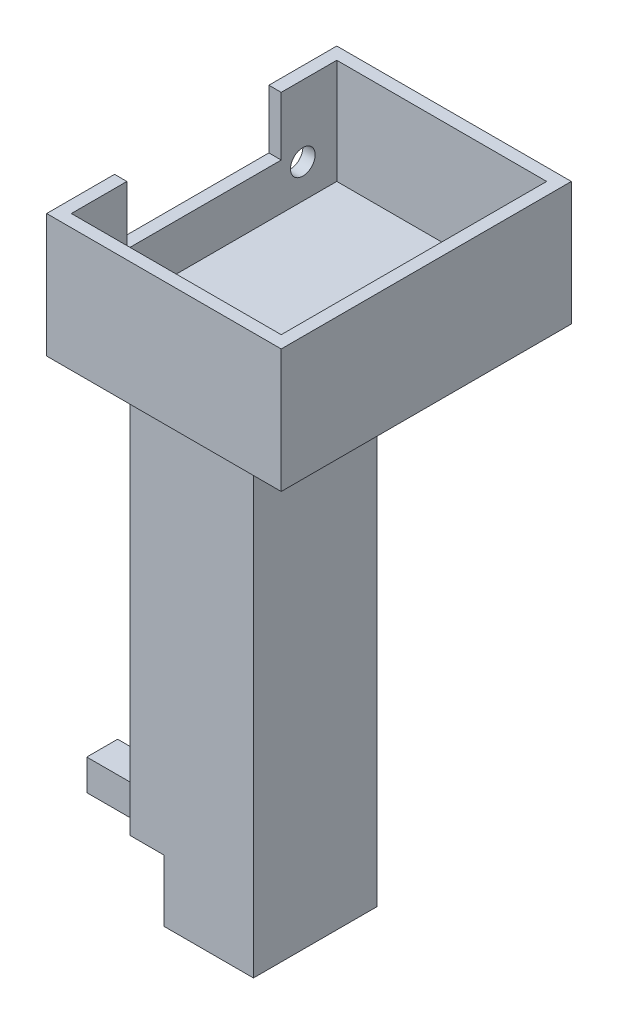
ISO-10303-21;
HEADER;
FILE_DESCRIPTION(('STEP AP214'),'2;1');
FILE_NAME('part.step','',(''),(''),'','','');
FILE_SCHEMA(('AUTOMOTIVE_DESIGN { 1 0 10303 214 1 1 1 1 }'));
ENDSEC;
DATA;
#1=APPLICATION_CONTEXT('core data for automotive mechanical design processes');
#2=APPLICATION_PROTOCOL_DEFINITION('international standard','automotive_design',2000,#1);
#3=PRODUCT_CONTEXT('',#1,'mechanical');
#4=PRODUCT('Part','Part','',(#3));
#5=PRODUCT_RELATED_PRODUCT_CATEGORY('part','',(#4));
#6=PRODUCT_DEFINITION_FORMATION('','',#4);
#7=PRODUCT_DEFINITION_CONTEXT('part definition',#1,'design');
#8=PRODUCT_DEFINITION('design','',#6,#7);
#9=PRODUCT_DEFINITION_SHAPE('','',#8);
#10=(LENGTH_UNIT() NAMED_UNIT(*) SI_UNIT(.MILLI.,.METRE.));
#11=(NAMED_UNIT(*) PLANE_ANGLE_UNIT() SI_UNIT($,.RADIAN.));
#12=(NAMED_UNIT(*) SI_UNIT($,.STERADIAN.) SOLID_ANGLE_UNIT());
#13=UNCERTAINTY_MEASURE_WITH_UNIT(LENGTH_MEASURE(1.E-05),#10,'distance_accuracy_value','');
#14=(GEOMETRIC_REPRESENTATION_CONTEXT(3) GLOBAL_UNCERTAINTY_ASSIGNED_CONTEXT((#13)) GLOBAL_UNIT_ASSIGNED_CONTEXT((#10,
#11,#12)) REPRESENTATION_CONTEXT('',''));
#15=CARTESIAN_POINT('',(0.,0.,0.));
#16=DIRECTION('',(0.,0.,1.));
#17=DIRECTION('',(1.,0.,0.));
#18=AXIS2_PLACEMENT_3D('',#15,#16,#17);
#19=CARTESIAN_POINT('',(12.,10.5,-95.));
#20=DIRECTION('',(1.,0.,0.));
#21=DIRECTION('',(0.,0.,-1.));
#22=AXIS2_PLACEMENT_3D('',#19,#20,#21);
#23=PLANE('',#22);
#24=CARTESIAN_POINT('',(12.,8.5,-87.5));
#25=DIRECTION('',(1.,0.,0.));
#26=DIRECTION('',(0.,0.,-1.));
#27=AXIS2_PLACEMENT_3D('',#24,#25,#26);
#28=CIRCLE('',#27,2.00000000000001);
#29=CARTESIAN_POINT('',(12.,8.5,-89.5));
#30=VERTEX_POINT('',#29);
#31=EDGE_CURVE('E294',#30,#30,#28,.F.);
#32=ORIENTED_EDGE('',*,*,#31,.F.);
#33=EDGE_LOOP('',(#32));
#34=FACE_BOUND('',#33,.T.);
#35=CARTESIAN_POINT('',(12.,8.5,-55.5));
#36=DIRECTION('',(1.,0.,0.));
#37=DIRECTION('',(0.,0.,-1.));
#38=AXIS2_PLACEMENT_3D('',#35,#36,#37);
#39=CIRCLE('',#38,2.);
#40=CARTESIAN_POINT('',(12.,8.5,-57.5));
#41=VERTEX_POINT('',#40);
#42=EDGE_CURVE('E293',#41,#41,#39,.F.);
#43=ORIENTED_EDGE('',*,*,#42,.F.);
#44=EDGE_LOOP('',(#43));
#45=FACE_BOUND('',#44,.T.);
#46=DIRECTION('',(0.,0.,-1.));
#47=VECTOR('',#46,1.);
#48=CARTESIAN_POINT('',(12.,-74.,-74.));
#49=LINE('',#48,#47);
#50=CARTESIAN_POINT('',(12.,-74.,-69.));
#51=VERTEX_POINT('',#50);
#52=CARTESIAN_POINT('',(12.,-74.,-74.));
#53=VERTEX_POINT('',#52);
#54=EDGE_CURVE('E207',#51,#53,#49,.T.);
#55=ORIENTED_EDGE('',*,*,#54,.F.);
#56=DIRECTION('',(0.,0.,-1.));
#57=VECTOR('',#56,1.);
#58=CARTESIAN_POINT('',(12.,-74.,-61.5));
#59=LINE('',#58,#57);
#60=CARTESIAN_POINT('',(12.,-74.,-61.5));
#61=VERTEX_POINT('',#60);
#62=EDGE_CURVE('E224',#61,#51,#59,.T.);
#63=ORIENTED_EDGE('',*,*,#62,.F.);
#64=DIRECTION('',(0.,1.,0.));
#65=VECTOR('',#64,1.);
#66=CARTESIAN_POINT('',(12.,-199.284271247462,-61.5));
#67=LINE('',#66,#65);
#68=CARTESIAN_POINT('',(12.,0.,-61.5));
#69=VERTEX_POINT('',#68);
#70=EDGE_CURVE('E280',#61,#69,#67,.T.);
#71=ORIENTED_EDGE('',*,*,#70,.T.);
#72=DIRECTION('',(0.,0.,1.));
#73=VECTOR('',#72,1.);
#74=CARTESIAN_POINT('',(12.,0.,-95.));
#75=LINE('',#74,#73);
#76=CARTESIAN_POINT('',(12.,0.,-48.));
#77=VERTEX_POINT('',#76);
#78=EDGE_CURVE('E386',#69,#77,#75,.T.);
#79=ORIENTED_EDGE('',*,*,#78,.T.);
#80=DIRECTION('',(0.,-1.,0.));
#81=VECTOR('',#80,1.);
#82=CARTESIAN_POINT('',(12.,10.5,-48.));
#83=LINE('',#82,#81);
#84=CARTESIAN_POINT('',(12.,20.,-48.));
#85=VERTEX_POINT('',#84);
#86=EDGE_CURVE('E393',#85,#77,#83,.T.);
#87=ORIENTED_EDGE('',*,*,#86,.F.);
#88=DIRECTION('',(0.,0.,1.));
#89=VECTOR('',#88,1.);
#90=CARTESIAN_POINT('',(12.,20.,-59.));
#91=LINE('',#90,#89);
#92=CARTESIAN_POINT('',(12.,20.,-59.));
#93=VERTEX_POINT('',#92);
#94=EDGE_CURVE('E310',#93,#85,#91,.T.);
#95=ORIENTED_EDGE('',*,*,#94,.F.);
#96=DIRECTION('',(0.,-1.,0.));
#97=VECTOR('',#96,1.);
#98=CARTESIAN_POINT('',(12.,20.,-59.));
#99=LINE('',#98,#97);
#100=CARTESIAN_POINT('',(12.,10.5,-59.));
#101=VERTEX_POINT('',#100);
#102=EDGE_CURVE('E345',#93,#101,#99,.T.);
#103=ORIENTED_EDGE('',*,*,#102,.T.);
#104=DIRECTION('',(0.,0.,1.));
#105=VECTOR('',#104,1.);
#106=CARTESIAN_POINT('',(12.,10.5,-95.));
#107=LINE('',#106,#105);
#108=CARTESIAN_POINT('',(12.,10.5,-84.));
#109=VERTEX_POINT('',#108);
#110=EDGE_CURVE('E378',#109,#101,#107,.T.);
#111=ORIENTED_EDGE('',*,*,#110,.F.);
#112=DIRECTION('',(0.,-1.,0.));
#113=VECTOR('',#112,1.);
#114=CARTESIAN_POINT('',(12.,20.,-84.));
#115=LINE('',#114,#113);
#116=CARTESIAN_POINT('',(12.,20.,-84.));
#117=VERTEX_POINT('',#116);
#118=EDGE_CURVE('E342',#117,#109,#115,.T.);
#119=ORIENTED_EDGE('',*,*,#118,.F.);
#120=DIRECTION('',(0.,0.,1.));
#121=VECTOR('',#120,1.);
#122=CARTESIAN_POINT('',(12.,20.,-84.));
#123=LINE('',#122,#121);
#124=CARTESIAN_POINT('',(12.,20.,-95.));
#125=VERTEX_POINT('',#124);
#126=EDGE_CURVE('E322',#125,#117,#123,.T.);
#127=ORIENTED_EDGE('',*,*,#126,.F.);
#128=DIRECTION('',(0.,-1.,0.));
#129=VECTOR('',#128,1.);
#130=CARTESIAN_POINT('',(12.,10.5,-95.));
#131=LINE('',#130,#129);
#132=CARTESIAN_POINT('',(12.,0.,-95.));
#133=VERTEX_POINT('',#132);
#134=EDGE_CURVE('E46',#125,#133,#131,.T.);
#135=ORIENTED_EDGE('',*,*,#134,.T.);
#136=CARTESIAN_POINT('',(12.,0.,-81.5));
#137=VERTEX_POINT('',#136);
#138=EDGE_CURVE('E387',#133,#137,#75,.T.);
#139=ORIENTED_EDGE('',*,*,#138,.T.);
#140=DIRECTION('',(0.,1.,0.));
#141=VECTOR('',#140,1.);
#142=CARTESIAN_POINT('',(12.,-199.284271247462,-81.5));
#143=LINE('',#142,#141);
#144=CARTESIAN_POINT('',(12.,-74.,-81.5));
#145=VERTEX_POINT('',#144);
#146=EDGE_CURVE('E287',#145,#137,#143,.T.);
#147=ORIENTED_EDGE('',*,*,#146,.F.);
#148=DIRECTION('',(0.,0.,-1.));
#149=VECTOR('',#148,1.);
#150=CARTESIAN_POINT('',(12.,-74.,-74.));
#151=LINE('',#150,#149);
#152=EDGE_CURVE('E222',#53,#145,#151,.T.);
#153=ORIENTED_EDGE('',*,*,#152,.F.);
#154=EDGE_LOOP('',(#55,#63,#71,#79,#87,#95,#103,#111,#119,#127,#135,#139,#147,#153));
#155=FACE_BOUND('',#154,.T.);
#156=ADVANCED_FACE('F38',(#34,#45,#155),#23,.F.);
#157=CARTESIAN_POINT('',(0.,-84.,0.));
#158=DIRECTION('',(0.,1.,0.));
#159=DIRECTION('',(0.,0.,1.));
#160=AXIS2_PLACEMENT_3D('',#157,#158,#159);
#161=PLANE('',#160);
#162=DIRECTION('',(0.,0.,1.));
#163=VECTOR('',#162,1.);
#164=CARTESIAN_POINT('',(17.5,-84.,-81.5));
#165=LINE('',#164,#163);
#166=CARTESIAN_POINT('',(17.5,-84.,-81.5));
#167=VERTEX_POINT('',#166);
#168=CARTESIAN_POINT('',(17.5,-84.,-61.5));
#169=VERTEX_POINT('',#168);
#170=EDGE_CURVE('E237',#167,#169,#165,.T.);
#171=ORIENTED_EDGE('',*,*,#170,.F.);
#172=DIRECTION('',(-1.,0.,0.));
#173=VECTOR('',#172,1.);
#174=CARTESIAN_POINT('',(12.,-84.,-81.5));
#175=LINE('',#174,#173);
#176=CARTESIAN_POINT('',(32.,-84.,-81.5));
#177=VERTEX_POINT('',#176);
#178=EDGE_CURVE('E269',#177,#167,#175,.T.);
#179=ORIENTED_EDGE('',*,*,#178,.F.);
#180=DIRECTION('',(0.,0.,-1.));
#181=VECTOR('',#180,1.);
#182=CARTESIAN_POINT('',(32.,-84.,-81.5));
#183=LINE('',#182,#181);
#184=CARTESIAN_POINT('',(32.,-84.,-61.5));
#185=VERTEX_POINT('',#184);
#186=EDGE_CURVE('E266',#185,#177,#183,.T.);
#187=ORIENTED_EDGE('',*,*,#186,.F.);
#188=DIRECTION('',(1.,0.,0.));
#189=VECTOR('',#188,1.);
#190=CARTESIAN_POINT('',(12.,-84.,-61.5));
#191=LINE('',#190,#189);
#192=EDGE_CURVE('E270',#169,#185,#191,.T.);
#193=ORIENTED_EDGE('',*,*,#192,.F.);
#194=EDGE_LOOP('',(#171,#179,#187,#193));
#195=FACE_BOUND('',#194,.T.);
#196=ADVANCED_FACE('F433',(#195),#161,.F.);
#197=CARTESIAN_POINT('',(0.,0.,0.));
#198=DIRECTION('',(0.,1.,0.));
#199=DIRECTION('',(0.,0.,1.));
#200=AXIS2_PLACEMENT_3D('',#197,#198,#199);
#201=PLANE('',#200);
#202=DIRECTION('',(-1.,0.,0.));
#203=VECTOR('',#202,1.);
#204=CARTESIAN_POINT('',(12.,0.,-61.5));
#205=LINE('',#204,#203);
#206=CARTESIAN_POINT('',(32.,0.,-61.5));
#207=VERTEX_POINT('',#206);
#208=EDGE_CURVE('E61',#207,#69,#205,.T.);
#209=ORIENTED_EDGE('',*,*,#208,.F.);
#210=DIRECTION('',(0.,0.,1.));
#211=VECTOR('',#210,1.);
#212=CARTESIAN_POINT('',(32.,0.,-81.5));
#213=LINE('',#212,#211);
#214=CARTESIAN_POINT('',(32.,0.,-81.5));
#215=VERTEX_POINT('',#214);
#216=EDGE_CURVE('E276',#215,#207,#213,.T.);
#217=ORIENTED_EDGE('',*,*,#216,.F.);
#218=DIRECTION('',(1.,0.,0.));
#219=VECTOR('',#218,1.);
#220=CARTESIAN_POINT('',(12.,0.,-81.5));
#221=LINE('',#220,#219);
#222=EDGE_CURVE('E255',#137,#215,#221,.T.);
#223=ORIENTED_EDGE('',*,*,#222,.F.);
#224=ORIENTED_EDGE('',*,*,#138,.F.);
#225=DIRECTION('',(-1.,0.,0.));
#226=VECTOR('',#225,1.);
#227=CARTESIAN_POINT('',(50.,0.,-95.));
#228=LINE('',#227,#226);
#229=CARTESIAN_POINT('',(50.,0.,-95.));
#230=VERTEX_POINT('',#229);
#231=EDGE_CURVE('E384',#230,#133,#228,.T.);
#232=ORIENTED_EDGE('',*,*,#231,.F.);
#233=DIRECTION('',(0.,0.,-1.));
#234=VECTOR('',#233,1.);
#235=CARTESIAN_POINT('',(50.,0.,-48.));
#236=LINE('',#235,#234);
#237=CARTESIAN_POINT('',(50.,0.,-48.));
#238=VERTEX_POINT('',#237);
#239=EDGE_CURVE('E377',#238,#230,#236,.T.);
#240=ORIENTED_EDGE('',*,*,#239,.F.);
#241=DIRECTION('',(1.,0.,0.));
#242=VECTOR('',#241,1.);
#243=CARTESIAN_POINT('',(12.,0.,-48.));
#244=LINE('',#243,#242);
#245=EDGE_CURVE('E381',#77,#238,#244,.T.);
#246=ORIENTED_EDGE('',*,*,#245,.F.);
#247=ORIENTED_EDGE('',*,*,#78,.F.);
#248=EDGE_LOOP('',(#209,#217,#223,#224,#232,#240,#246,#247));
#249=FACE_BOUND('',#248,.T.);
#250=ADVANCED_FACE('F404',(#249),#201,.F.);
#251=CARTESIAN_POINT('',(0.,10.5,0.));
#252=DIRECTION('',(0.,1.,0.));
#253=DIRECTION('',(0.,0.,1.));
#254=AXIS2_PLACEMENT_3D('',#251,#252,#253);
#255=PLANE('',#254);
#256=DIRECTION('',(1.,0.,0.));
#257=VECTOR('',#256,1.);
#258=CARTESIAN_POINT('',(14.,10.5,-84.));
#259=LINE('',#258,#257);
#260=CARTESIAN_POINT('',(14.,10.5,-84.));
#261=VERTEX_POINT('',#260);
#262=EDGE_CURVE('E306',#109,#261,#259,.T.);
#263=ORIENTED_EDGE('',*,*,#262,.F.);
#264=ORIENTED_EDGE('',*,*,#110,.T.);
#265=DIRECTION('',(-1.,0.,0.));
#266=VECTOR('',#265,1.);
#267=CARTESIAN_POINT('',(14.,10.5,-59.));
#268=LINE('',#267,#266);
#269=CARTESIAN_POINT('',(14.,10.5,-59.));
#270=VERTEX_POINT('',#269);
#271=EDGE_CURVE('E297',#270,#101,#268,.T.);
#272=ORIENTED_EDGE('',*,*,#271,.F.);
#273=DIRECTION('',(0.,0.,1.));
#274=VECTOR('',#273,1.);
#275=CARTESIAN_POINT('',(14.,10.5,-93.));
#276=LINE('',#275,#274);
#277=EDGE_CURVE('E363',#261,#270,#276,.T.);
#278=ORIENTED_EDGE('',*,*,#277,.F.);
#279=EDGE_LOOP('',(#263,#264,#272,#278));
#280=FACE_BOUND('',#279,.T.);
#281=ADVANCED_FACE('F440',(#280),#255,.T.);
#282=CARTESIAN_POINT('',(50.,10.5,-48.));
#283=DIRECTION('',(-1.,0.,0.));
#284=DIRECTION('',(0.,0.,1.));
#285=AXIS2_PLACEMENT_3D('',#282,#283,#284);
#286=PLANE('',#285);
#287=ORIENTED_EDGE('',*,*,#239,.T.);
#288=DIRECTION('',(0.,-1.,0.));
#289=VECTOR('',#288,1.);
#290=CARTESIAN_POINT('',(50.,10.5,-95.));
#291=LINE('',#290,#289);
#292=CARTESIAN_POINT('',(50.,20.,-95.));
#293=VERTEX_POINT('',#292);
#294=EDGE_CURVE('E12',#293,#230,#291,.T.);
#295=ORIENTED_EDGE('',*,*,#294,.F.);
#296=DIRECTION('',(0.,0.,-1.));
#297=VECTOR('',#296,1.);
#298=CARTESIAN_POINT('',(50.,20.,-48.));
#299=LINE('',#298,#297);
#300=CARTESIAN_POINT('',(50.,20.,-48.));
#301=VERTEX_POINT('',#300);
#302=EDGE_CURVE('E316',#301,#293,#299,.T.);
#303=ORIENTED_EDGE('',*,*,#302,.F.);
#304=DIRECTION('',(0.,-1.,0.));
#305=VECTOR('',#304,1.);
#306=CARTESIAN_POINT('',(50.,10.5,-48.));
#307=LINE('',#306,#305);
#308=EDGE_CURVE('E380',#301,#238,#307,.T.);
#309=ORIENTED_EDGE('',*,*,#308,.T.);
#310=EDGE_LOOP('',(#287,#295,#303,#309));
#311=FACE_BOUND('',#310,.T.);
#312=ADVANCED_FACE('F40',(#311),#286,.F.);
#313=CARTESIAN_POINT('',(50.,10.5,-95.));
#314=DIRECTION('',(0.,0.,1.));
#315=DIRECTION('',(1.,0.,0.));
#316=AXIS2_PLACEMENT_3D('',#313,#314,#315);
#317=PLANE('',#316);
#318=ORIENTED_EDGE('',*,*,#231,.T.);
#319=ORIENTED_EDGE('',*,*,#134,.F.);
#320=DIRECTION('',(-1.,0.,0.));
#321=VECTOR('',#320,1.);
#322=CARTESIAN_POINT('',(12.,20.,-95.));
#323=LINE('',#322,#321);
#324=EDGE_CURVE('E319',#293,#125,#323,.T.);
#325=ORIENTED_EDGE('',*,*,#324,.F.);
#326=ORIENTED_EDGE('',*,*,#294,.T.);
#327=EDGE_LOOP('',(#318,#319,#325,#326));
#328=FACE_BOUND('',#327,.T.);
#329=ADVANCED_FACE('F498',(#328),#317,.F.);
#330=CARTESIAN_POINT('',(12.,10.5,-48.));
#331=DIRECTION('',(0.,0.,-1.));
#332=DIRECTION('',(-1.,0.,0.));
#333=AXIS2_PLACEMENT_3D('',#330,#331,#332);
#334=PLANE('',#333);
#335=ORIENTED_EDGE('',*,*,#245,.T.);
#336=ORIENTED_EDGE('',*,*,#308,.F.);
#337=DIRECTION('',(1.,0.,0.));
#338=VECTOR('',#337,1.);
#339=CARTESIAN_POINT('',(12.,20.,-48.));
#340=LINE('',#339,#338);
#341=EDGE_CURVE('E313',#85,#301,#340,.T.);
#342=ORIENTED_EDGE('',*,*,#341,.F.);
#343=ORIENTED_EDGE('',*,*,#86,.T.);
#344=EDGE_LOOP('',(#335,#336,#342,#343));
#345=FACE_BOUND('',#344,.T.);
#346=ADVANCED_FACE('F492',(#345),#334,.F.);
#347=CARTESIAN_POINT('',(48.,10.5,-93.));
#348=DIRECTION('',(0.,0.,1.));
#349=DIRECTION('',(1.,0.,0.));
#350=AXIS2_PLACEMENT_3D('',#347,#348,#349);
#351=PLANE('',#350);
#352=DIRECTION('',(-1.,0.,0.));
#353=VECTOR('',#352,1.);
#354=CARTESIAN_POINT('',(14.,3.,-93.));
#355=LINE('',#354,#353);
#356=CARTESIAN_POINT('',(48.,3.,-93.));
#357=VERTEX_POINT('',#356);
#358=CARTESIAN_POINT('',(14.,3.,-93.));
#359=VERTEX_POINT('',#358);
#360=EDGE_CURVE('E360',#357,#359,#355,.T.);
#361=ORIENTED_EDGE('',*,*,#360,.F.);
#362=DIRECTION('',(0.,-1.,0.));
#363=VECTOR('',#362,1.);
#364=CARTESIAN_POINT('',(48.,10.5,-93.));
#365=LINE('',#364,#363);
#366=CARTESIAN_POINT('',(48.,20.,-93.));
#367=VERTEX_POINT('',#366);
#368=EDGE_CURVE('E366',#367,#357,#365,.T.);
#369=ORIENTED_EDGE('',*,*,#368,.F.);
#370=DIRECTION('',(1.,0.,0.));
#371=VECTOR('',#370,1.);
#372=CARTESIAN_POINT('',(48.,20.,-93.));
#373=LINE('',#372,#371);
#374=CARTESIAN_POINT('',(14.,20.,-93.));
#375=VERTEX_POINT('',#374);
#376=EDGE_CURVE('E329',#375,#367,#373,.T.);
#377=ORIENTED_EDGE('',*,*,#376,.F.);
#378=DIRECTION('',(0.,-1.,0.));
#379=VECTOR('',#378,1.);
#380=CARTESIAN_POINT('',(14.,10.5,-93.));
#381=LINE('',#380,#379);
#382=EDGE_CURVE('E374',#375,#359,#381,.T.);
#383=ORIENTED_EDGE('',*,*,#382,.T.);
#384=EDGE_LOOP('',(#361,#369,#377,#383));
#385=FACE_BOUND('',#384,.T.);
#386=ADVANCED_FACE('F488',(#385),#351,.T.);
#387=CARTESIAN_POINT('',(14.,10.5,-93.));
#388=DIRECTION('',(1.,0.,0.));
#389=DIRECTION('',(0.,0.,-1.));
#390=AXIS2_PLACEMENT_3D('',#387,#388,#389);
#391=PLANE('',#390);
#392=CARTESIAN_POINT('',(14.,8.5,-55.5));
#393=DIRECTION('',(1.,0.,0.));
#394=DIRECTION('',(0.,0.,-1.));
#395=AXIS2_PLACEMENT_3D('',#392,#393,#394);
#396=CIRCLE('',#395,2.);
#397=CARTESIAN_POINT('',(14.,8.5,-57.5));
#398=VERTEX_POINT('',#397);
#399=EDGE_CURVE('E290',#398,#398,#396,.T.);
#400=ORIENTED_EDGE('',*,*,#399,.F.);
#401=EDGE_LOOP('',(#400));
#402=FACE_BOUND('',#401,.T.);
#403=CARTESIAN_POINT('',(14.,8.5,-87.5));
#404=DIRECTION('',(1.,0.,0.));
#405=DIRECTION('',(0.,0.,1.));
#406=AXIS2_PLACEMENT_3D('',#403,#404,#405);
#407=CIRCLE('',#406,2.00000000000001);
#408=CARTESIAN_POINT('',(14.,8.5,-85.5));
#409=VERTEX_POINT('',#408);
#410=EDGE_CURVE('E273',#409,#409,#407,.T.);
#411=ORIENTED_EDGE('',*,*,#410,.F.);
#412=EDGE_LOOP('',(#411));
#413=FACE_BOUND('',#412,.T.);
#414=DIRECTION('',(0.,0.,1.));
#415=VECTOR('',#414,1.);
#416=CARTESIAN_POINT('',(14.,3.,-93.));
#417=LINE('',#416,#415);
#418=CARTESIAN_POINT('',(14.,3.,-50.));
#419=VERTEX_POINT('',#418);
#420=EDGE_CURVE('E351',#359,#419,#417,.T.);
#421=ORIENTED_EDGE('',*,*,#420,.F.);
#422=ORIENTED_EDGE('',*,*,#382,.F.);
#423=DIRECTION('',(0.,0.,-1.));
#424=VECTOR('',#423,1.);
#425=CARTESIAN_POINT('',(14.,20.,-93.));
#426=LINE('',#425,#424);
#427=CARTESIAN_POINT('',(14.,20.,-84.));
#428=VERTEX_POINT('',#427);
#429=EDGE_CURVE('E326',#428,#375,#426,.T.);
#430=ORIENTED_EDGE('',*,*,#429,.F.);
#431=DIRECTION('',(0.,-1.,0.));
#432=VECTOR('',#431,1.);
#433=CARTESIAN_POINT('',(14.,20.,-84.));
#434=LINE('',#433,#432);
#435=EDGE_CURVE('E335',#428,#261,#434,.T.);
#436=ORIENTED_EDGE('',*,*,#435,.T.);
#437=ORIENTED_EDGE('',*,*,#277,.T.);
#438=DIRECTION('',(0.,-1.,0.));
#439=VECTOR('',#438,1.);
#440=CARTESIAN_POINT('',(14.,20.,-59.));
#441=LINE('',#440,#439);
#442=CARTESIAN_POINT('',(14.,20.,-59.));
#443=VERTEX_POINT('',#442);
#444=EDGE_CURVE('E348',#443,#270,#441,.T.);
#445=ORIENTED_EDGE('',*,*,#444,.F.);
#446=DIRECTION('',(0.,0.,-1.));
#447=VECTOR('',#446,1.);
#448=CARTESIAN_POINT('',(14.,20.,-50.));
#449=LINE('',#448,#447);
#450=CARTESIAN_POINT('',(14.,20.,-50.));
#451=VERTEX_POINT('',#450);
#452=EDGE_CURVE('E305',#451,#443,#449,.T.);
#453=ORIENTED_EDGE('',*,*,#452,.F.);
#454=DIRECTION('',(0.,-1.,0.));
#455=VECTOR('',#454,1.);
#456=CARTESIAN_POINT('',(14.,10.5,-50.));
#457=LINE('',#456,#455);
#458=EDGE_CURVE('E371',#451,#419,#457,.T.);
#459=ORIENTED_EDGE('',*,*,#458,.T.);
#460=EDGE_LOOP('',(#421,#422,#430,#436,#437,#445,#453,#459));
#461=FACE_BOUND('',#460,.T.);
#462=ADVANCED_FACE('F484',(#402,#413,#461),#391,.T.);
#463=CARTESIAN_POINT('',(14.,10.5,-50.));
#464=DIRECTION('',(0.,0.,-1.));
#465=DIRECTION('',(-1.,0.,0.));
#466=AXIS2_PLACEMENT_3D('',#463,#464,#465);
#467=PLANE('',#466);
#468=DIRECTION('',(1.,0.,0.));
#469=VECTOR('',#468,1.);
#470=CARTESIAN_POINT('',(14.,3.,-50.));
#471=LINE('',#470,#469);
#472=CARTESIAN_POINT('',(48.,3.,-50.));
#473=VERTEX_POINT('',#472);
#474=EDGE_CURVE('E354',#419,#473,#471,.T.);
#475=ORIENTED_EDGE('',*,*,#474,.F.);
#476=ORIENTED_EDGE('',*,*,#458,.F.);
#477=DIRECTION('',(-1.,0.,0.));
#478=VECTOR('',#477,1.);
#479=CARTESIAN_POINT('',(48.,20.,-50.));
#480=LINE('',#479,#478);
#481=CARTESIAN_POINT('',(48.,20.,-50.));
#482=VERTEX_POINT('',#481);
#483=EDGE_CURVE('E302',#482,#451,#480,.T.);
#484=ORIENTED_EDGE('',*,*,#483,.F.);
#485=DIRECTION('',(0.,-1.,0.));
#486=VECTOR('',#485,1.);
#487=CARTESIAN_POINT('',(48.,10.5,-50.));
#488=LINE('',#487,#486);
#489=EDGE_CURVE('E368',#482,#473,#488,.T.);
#490=ORIENTED_EDGE('',*,*,#489,.T.);
#491=EDGE_LOOP('',(#475,#476,#484,#490));
#492=FACE_BOUND('',#491,.T.);
#493=ADVANCED_FACE('F480',(#492),#467,.T.);
#494=CARTESIAN_POINT('',(48.,10.5,-50.));
#495=DIRECTION('',(-1.,0.,0.));
#496=DIRECTION('',(0.,0.,1.));
#497=AXIS2_PLACEMENT_3D('',#494,#495,#496);
#498=PLANE('',#497);
#499=DIRECTION('',(0.,0.,-1.));
#500=VECTOR('',#499,1.);
#501=CARTESIAN_POINT('',(48.,3.,-93.));
#502=LINE('',#501,#500);
#503=EDGE_CURVE('E357',#473,#357,#502,.T.);
#504=ORIENTED_EDGE('',*,*,#503,.F.);
#505=ORIENTED_EDGE('',*,*,#489,.F.);
#506=DIRECTION('',(0.,0.,1.));
#507=VECTOR('',#506,1.);
#508=CARTESIAN_POINT('',(48.,20.,-93.));
#509=LINE('',#508,#507);
#510=EDGE_CURVE('E332',#367,#482,#509,.T.);
#511=ORIENTED_EDGE('',*,*,#510,.F.);
#512=ORIENTED_EDGE('',*,*,#368,.T.);
#513=EDGE_LOOP('',(#504,#505,#511,#512));
#514=FACE_BOUND('',#513,.T.);
#515=ADVANCED_FACE('F476',(#514),#498,.T.);
#516=CARTESIAN_POINT('',(0.,3.,0.));
#517=DIRECTION('',(0.,1.,0.));
#518=DIRECTION('',(0.,0.,1.));
#519=AXIS2_PLACEMENT_3D('',#516,#517,#518);
#520=PLANE('',#519);
#521=ORIENTED_EDGE('',*,*,#420,.T.);
#522=ORIENTED_EDGE('',*,*,#474,.T.);
#523=ORIENTED_EDGE('',*,*,#503,.T.);
#524=ORIENTED_EDGE('',*,*,#360,.T.);
#525=EDGE_LOOP('',(#521,#522,#523,#524));
#526=FACE_BOUND('',#525,.T.);
#527=ADVANCED_FACE('F472',(#526),#520,.T.);
#528=CARTESIAN_POINT('',(14.,20.,-59.));
#529=DIRECTION('',(0.,0.,1.));
#530=DIRECTION('',(1.,0.,0.));
#531=AXIS2_PLACEMENT_3D('',#528,#529,#530);
#532=PLANE('',#531);
#533=ORIENTED_EDGE('',*,*,#271,.T.);
#534=ORIENTED_EDGE('',*,*,#102,.F.);
#535=DIRECTION('',(-1.,0.,0.));
#536=VECTOR('',#535,1.);
#537=CARTESIAN_POINT('',(14.,20.,-59.));
#538=LINE('',#537,#536);
#539=EDGE_CURVE('E308',#443,#93,#538,.T.);
#540=ORIENTED_EDGE('',*,*,#539,.F.);
#541=ORIENTED_EDGE('',*,*,#444,.T.);
#542=EDGE_LOOP('',(#533,#534,#540,#541));
#543=FACE_BOUND('',#542,.T.);
#544=ADVANCED_FACE('F468',(#543),#532,.F.);
#545=CARTESIAN_POINT('',(14.,20.,-84.));
#546=DIRECTION('',(0.,0.,-1.));
#547=DIRECTION('',(-1.,0.,0.));
#548=AXIS2_PLACEMENT_3D('',#545,#546,#547);
#549=PLANE('',#548);
#550=ORIENTED_EDGE('',*,*,#262,.T.);
#551=ORIENTED_EDGE('',*,*,#435,.F.);
#552=DIRECTION('',(1.,0.,0.));
#553=VECTOR('',#552,1.);
#554=CARTESIAN_POINT('',(14.,20.,-84.));
#555=LINE('',#554,#553);
#556=EDGE_CURVE('E324',#117,#428,#555,.T.);
#557=ORIENTED_EDGE('',*,*,#556,.F.);
#558=ORIENTED_EDGE('',*,*,#118,.T.);
#559=EDGE_LOOP('',(#550,#551,#557,#558));
#560=FACE_BOUND('',#559,.T.);
#561=ADVANCED_FACE('F464',(#560),#549,.F.);
#562=CARTESIAN_POINT('',(0.,20.,0.));
#563=DIRECTION('',(0.,-1.,0.));
#564=DIRECTION('',(0.,0.,-1.));
#565=AXIS2_PLACEMENT_3D('',#562,#563,#564);
#566=PLANE('',#565);
#567=ORIENTED_EDGE('',*,*,#483,.T.);
#568=ORIENTED_EDGE('',*,*,#452,.T.);
#569=ORIENTED_EDGE('',*,*,#539,.T.);
#570=ORIENTED_EDGE('',*,*,#94,.T.);
#571=ORIENTED_EDGE('',*,*,#341,.T.);
#572=ORIENTED_EDGE('',*,*,#302,.T.);
#573=ORIENTED_EDGE('',*,*,#324,.T.);
#574=ORIENTED_EDGE('',*,*,#126,.T.);
#575=ORIENTED_EDGE('',*,*,#556,.T.);
#576=ORIENTED_EDGE('',*,*,#429,.T.);
#577=ORIENTED_EDGE('',*,*,#376,.T.);
#578=ORIENTED_EDGE('',*,*,#510,.T.);
#579=EDGE_LOOP('',(#567,#568,#569,#570,#571,#572,#573,#574,#575,#576,#577,#578));
#580=FACE_BOUND('',#579,.T.);
#581=ADVANCED_FACE('F460',(#580),#566,.F.);
#582=CARTESIAN_POINT('',(11.999,8.5,-87.5));
#583=DIRECTION('',(1.,0.,0.));
#584=DIRECTION('',(0.,0.,-1.));
#585=AXIS2_PLACEMENT_3D('',#582,#583,#584);
#586=CYLINDRICAL_SURFACE('',#585,2.00000000000001);
#587=ORIENTED_EDGE('',*,*,#410,.T.);
#588=EDGE_LOOP('',(#587));
#589=FACE_BOUND('',#588,.T.);
#590=ORIENTED_EDGE('',*,*,#31,.T.);
#591=EDGE_LOOP('',(#590));
#592=FACE_BOUND('',#591,.T.);
#593=ADVANCED_FACE('F456',(#589,#592),#586,.F.);
#594=CARTESIAN_POINT('',(11.999,8.5,-55.5));
#595=DIRECTION('',(1.,0.,0.));
#596=DIRECTION('',(0.,0.,-1.));
#597=AXIS2_PLACEMENT_3D('',#594,#595,#596);
#598=CYLINDRICAL_SURFACE('',#597,2.);
#599=ORIENTED_EDGE('',*,*,#399,.T.);
#600=EDGE_LOOP('',(#599));
#601=FACE_BOUND('',#600,.T.);
#602=ORIENTED_EDGE('',*,*,#42,.T.);
#603=EDGE_LOOP('',(#602));
#604=FACE_BOUND('',#603,.T.);
#605=ADVANCED_FACE('F449',(#601,#604),#598,.F.);
#606=CARTESIAN_POINT('',(12.,-199.284271247462,-61.5));
#607=DIRECTION('',(0.,0.,-1.));
#608=DIRECTION('',(-1.,0.,0.));
#609=AXIS2_PLACEMENT_3D('',#606,#607,#608);
#610=PLANE('',#609);
#611=ORIENTED_EDGE('',*,*,#70,.F.);
#612=DIRECTION('',(-1.,0.,0.));
#613=VECTOR('',#612,1.);
#614=CARTESIAN_POINT('',(17.5,-74.,-61.5));
#615=LINE('',#614,#613);
#616=CARTESIAN_POINT('',(17.5,-74.,-61.5));
#617=VERTEX_POINT('',#616);
#618=EDGE_CURVE('E259',#617,#61,#615,.T.);
#619=ORIENTED_EDGE('',*,*,#618,.F.);
#620=DIRECTION('',(0.,1.,0.));
#621=VECTOR('',#620,1.);
#622=CARTESIAN_POINT('',(17.5,-84.,-61.5));
#623=LINE('',#622,#621);
#624=EDGE_CURVE('E239',#169,#617,#623,.T.);
#625=ORIENTED_EDGE('',*,*,#624,.F.);
#626=ORIENTED_EDGE('',*,*,#192,.T.);
#627=DIRECTION('',(0.,1.,0.));
#628=VECTOR('',#627,1.);
#629=CARTESIAN_POINT('',(32.,-199.284271247462,-61.5));
#630=LINE('',#629,#628);
#631=EDGE_CURVE('E282',#185,#207,#630,.T.);
#632=ORIENTED_EDGE('',*,*,#631,.T.);
#633=ORIENTED_EDGE('',*,*,#208,.T.);
#634=EDGE_LOOP('',(#611,#619,#625,#626,#632,#633));
#635=FACE_BOUND('',#634,.T.);
#636=ADVANCED_FACE('F426',(#635),#610,.F.);
#637=CARTESIAN_POINT('',(32.,-199.284271247462,-81.5));
#638=DIRECTION('',(-1.,0.,0.));
#639=DIRECTION('',(0.,0.,1.));
#640=AXIS2_PLACEMENT_3D('',#637,#638,#639);
#641=PLANE('',#640);
#642=ORIENTED_EDGE('',*,*,#631,.F.);
#643=ORIENTED_EDGE('',*,*,#186,.T.);
#644=DIRECTION('',(0.,1.,0.));
#645=VECTOR('',#644,1.);
#646=CARTESIAN_POINT('',(32.,-199.284271247462,-81.5));
#647=LINE('',#646,#645);
#648=EDGE_CURVE('E284',#177,#215,#647,.T.);
#649=ORIENTED_EDGE('',*,*,#648,.T.);
#650=ORIENTED_EDGE('',*,*,#216,.T.);
#651=EDGE_LOOP('',(#642,#643,#649,#650));
#652=FACE_BOUND('',#651,.T.);
#653=ADVANCED_FACE('F431',(#652),#641,.F.);
#654=CARTESIAN_POINT('',(12.,-199.284271247462,-81.5));
#655=DIRECTION('',(0.,0.,1.));
#656=DIRECTION('',(1.,0.,0.));
#657=AXIS2_PLACEMENT_3D('',#654,#655,#656);
#658=PLANE('',#657);
#659=DIRECTION('',(0.,-1.,0.));
#660=VECTOR('',#659,1.);
#661=CARTESIAN_POINT('',(17.5,-74.,-81.5));
#662=LINE('',#661,#660);
#663=CARTESIAN_POINT('',(17.5,-74.,-81.5));
#664=VERTEX_POINT('',#663);
#665=EDGE_CURVE('E53',#664,#167,#662,.T.);
#666=ORIENTED_EDGE('',*,*,#665,.F.);
#667=DIRECTION('',(-1.,0.,0.));
#668=VECTOR('',#667,1.);
#669=CARTESIAN_POINT('',(17.5,-74.,-81.5));
#670=LINE('',#669,#668);
#671=EDGE_CURVE('E261',#664,#145,#670,.T.);
#672=ORIENTED_EDGE('',*,*,#671,.T.);
#673=ORIENTED_EDGE('',*,*,#146,.T.);
#674=ORIENTED_EDGE('',*,*,#222,.T.);
#675=ORIENTED_EDGE('',*,*,#648,.F.);
#676=ORIENTED_EDGE('',*,*,#178,.T.);
#677=EDGE_LOOP('',(#666,#672,#673,#674,#675,#676));
#678=FACE_BOUND('',#677,.T.);
#679=ADVANCED_FACE('F408',(#678),#658,.F.);
#680=CARTESIAN_POINT('',(17.5,-79.,-74.));
#681=DIRECTION('',(0.,0.,1.));
#682=DIRECTION('',(1.,0.,0.));
#683=AXIS2_PLACEMENT_3D('',#680,#681,#682);
#684=PLANE('',#683);
#685=DIRECTION('',(-1.,0.,0.));
#686=VECTOR('',#685,1.);
#687=CARTESIAN_POINT('',(17.5,-79.,-74.));
#688=LINE('',#687,#686);
#689=CARTESIAN_POINT('',(17.5,-79.,-74.));
#690=VERTEX_POINT('',#689);
#691=CARTESIAN_POINT('',(-2.50000000000001,-79.,-74.));
#692=VERTEX_POINT('',#691);
#693=EDGE_CURVE('E253',#690,#692,#688,.T.);
#694=ORIENTED_EDGE('',*,*,#693,.T.);
#695=DIRECTION('',(0.,-1.,0.));
#696=VECTOR('',#695,1.);
#697=CARTESIAN_POINT('',(-2.50000000000001,-79.,-74.));
#698=LINE('',#697,#696);
#699=CARTESIAN_POINT('',(-2.50000000000001,-74.,-74.));
#700=VERTEX_POINT('',#699);
#701=EDGE_CURVE('E217',#700,#692,#698,.T.);
#702=ORIENTED_EDGE('',*,*,#701,.F.);
#703=DIRECTION('',(1.,0.,0.));
#704=VECTOR('',#703,1.);
#705=CARTESIAN_POINT('',(-29.5710678118655,-74.,-74.));
#706=LINE('',#705,#704);
#707=EDGE_CURVE('E208',#700,#53,#706,.T.);
#708=ORIENTED_EDGE('',*,*,#707,.T.);
#709=DIRECTION('',(-1.,0.,0.));
#710=VECTOR('',#709,1.);
#711=CARTESIAN_POINT('',(17.5,-74.,-74.));
#712=LINE('',#711,#710);
#713=CARTESIAN_POINT('',(17.5,-74.,-74.));
#714=VERTEX_POINT('',#713);
#715=EDGE_CURVE('E250',#714,#53,#712,.T.);
#716=ORIENTED_EDGE('',*,*,#715,.F.);
#717=DIRECTION('',(0.,1.,0.));
#718=VECTOR('',#717,1.);
#719=CARTESIAN_POINT('',(17.5,-79.,-74.));
#720=LINE('',#719,#718);
#721=EDGE_CURVE('E231',#690,#714,#720,.T.);
#722=ORIENTED_EDGE('',*,*,#721,.F.);
#723=EDGE_LOOP('',(#694,#702,#708,#716,#722));
#724=FACE_BOUND('',#723,.T.);
#725=ADVANCED_FACE('F415',(#724),#684,.F.);
#726=CARTESIAN_POINT('',(17.5,-79.,-69.));
#727=DIRECTION('',(0.,1.,0.));
#728=DIRECTION('',(0.,0.,1.));
#729=AXIS2_PLACEMENT_3D('',#726,#727,#728);
#730=PLANE('',#729);
#731=DIRECTION('',(-1.,0.,0.));
#732=VECTOR('',#731,1.);
#733=CARTESIAN_POINT('',(17.5,-79.,-69.));
#734=LINE('',#733,#732);
#735=CARTESIAN_POINT('',(17.5,-79.,-69.));
#736=VERTEX_POINT('',#735);
#737=CARTESIAN_POINT('',(-2.50000000000001,-79.,-69.));
#738=VERTEX_POINT('',#737);
#739=EDGE_CURVE('E256',#736,#738,#734,.T.);
#740=ORIENTED_EDGE('',*,*,#739,.T.);
#741=DIRECTION('',(0.,0.,1.));
#742=VECTOR('',#741,1.);
#743=CARTESIAN_POINT('',(-2.50000000000001,-79.,-74.));
#744=LINE('',#743,#742);
#745=EDGE_CURVE('E221',#692,#738,#744,.T.);
#746=ORIENTED_EDGE('',*,*,#745,.F.);
#747=ORIENTED_EDGE('',*,*,#693,.F.);
#748=DIRECTION('',(0.,0.,-1.));
#749=VECTOR('',#748,1.);
#750=CARTESIAN_POINT('',(17.5,-79.,-69.));
#751=LINE('',#750,#749);
#752=EDGE_CURVE('E248',#736,#690,#751,.T.);
#753=ORIENTED_EDGE('',*,*,#752,.F.);
#754=EDGE_LOOP('',(#740,#746,#747,#753));
#755=FACE_BOUND('',#754,.T.);
#756=ADVANCED_FACE('F418',(#755),#730,.F.);
#757=CARTESIAN_POINT('',(17.5,-74.,-69.));
#758=DIRECTION('',(0.,0.,-1.));
#759=DIRECTION('',(-1.,0.,0.));
#760=AXIS2_PLACEMENT_3D('',#757,#758,#759);
#761=PLANE('',#760);
#762=DIRECTION('',(-1.,0.,0.));
#763=VECTOR('',#762,1.);
#764=CARTESIAN_POINT('',(17.5,-74.,-69.));
#765=LINE('',#764,#763);
#766=CARTESIAN_POINT('',(17.5,-74.,-69.));
#767=VERTEX_POINT('',#766);
#768=EDGE_CURVE('E203',#767,#51,#765,.T.);
#769=ORIENTED_EDGE('',*,*,#768,.T.);
#770=DIRECTION('',(1.,0.,0.));
#771=VECTOR('',#770,1.);
#772=CARTESIAN_POINT('',(-29.5710678118655,-74.,-69.));
#773=LINE('',#772,#771);
#774=CARTESIAN_POINT('',(-2.50000000000001,-74.,-69.));
#775=VERTEX_POINT('',#774);
#776=EDGE_CURVE('E196',#775,#51,#773,.T.);
#777=ORIENTED_EDGE('',*,*,#776,.F.);
#778=DIRECTION('',(0.,1.,0.));
#779=VECTOR('',#778,1.);
#780=CARTESIAN_POINT('',(-2.50000000000001,-79.,-69.));
#781=LINE('',#780,#779);
#782=EDGE_CURVE('E200',#738,#775,#781,.T.);
#783=ORIENTED_EDGE('',*,*,#782,.F.);
#784=ORIENTED_EDGE('',*,*,#739,.F.);
#785=DIRECTION('',(0.,-1.,0.));
#786=VECTOR('',#785,1.);
#787=CARTESIAN_POINT('',(17.5,-74.,-69.));
#788=LINE('',#787,#786);
#789=EDGE_CURVE('E245',#767,#736,#788,.T.);
#790=ORIENTED_EDGE('',*,*,#789,.F.);
#791=EDGE_LOOP('',(#769,#777,#783,#784,#790));
#792=FACE_BOUND('',#791,.T.);
#793=ADVANCED_FACE('F198',(#792),#761,.F.);
#794=CARTESIAN_POINT('',(17.5,-74.,-61.5));
#795=DIRECTION('',(0.,1.,0.));
#796=DIRECTION('',(0.,0.,1.));
#797=AXIS2_PLACEMENT_3D('',#794,#795,#796);
#798=PLANE('',#797);
#799=ORIENTED_EDGE('',*,*,#62,.T.);
#800=ORIENTED_EDGE('',*,*,#768,.F.);
#801=DIRECTION('',(0.,0.,-1.));
#802=VECTOR('',#801,1.);
#803=CARTESIAN_POINT('',(17.5,-74.,-61.5));
#804=LINE('',#803,#802);
#805=EDGE_CURVE('E242',#617,#767,#804,.T.);
#806=ORIENTED_EDGE('',*,*,#805,.F.);
#807=ORIENTED_EDGE('',*,*,#618,.T.);
#808=EDGE_LOOP('',(#799,#800,#806,#807));
#809=FACE_BOUND('',#808,.T.);
#810=ADVANCED_FACE('F423',(#809),#798,.F.);
#811=CARTESIAN_POINT('',(17.5,-74.,-74.));
#812=DIRECTION('',(0.,1.,0.));
#813=DIRECTION('',(0.,0.,1.));
#814=AXIS2_PLACEMENT_3D('',#811,#812,#813);
#815=PLANE('',#814);
#816=ORIENTED_EDGE('',*,*,#152,.T.);
#817=ORIENTED_EDGE('',*,*,#671,.F.);
#818=DIRECTION('',(0.,0.,-1.));
#819=VECTOR('',#818,1.);
#820=CARTESIAN_POINT('',(17.5,-74.,-74.));
#821=LINE('',#820,#819);
#822=EDGE_CURVE('E234',#714,#664,#821,.T.);
#823=ORIENTED_EDGE('',*,*,#822,.F.);
#824=ORIENTED_EDGE('',*,*,#715,.T.);
#825=EDGE_LOOP('',(#816,#817,#823,#824));
#826=FACE_BOUND('',#825,.T.);
#827=ADVANCED_FACE('F412',(#826),#815,.F.);
#828=CARTESIAN_POINT('',(17.5,0.,0.));
#829=DIRECTION('',(-1.,0.,0.));
#830=DIRECTION('',(0.,0.,1.));
#831=AXIS2_PLACEMENT_3D('',#828,#829,#830);
#832=PLANE('',#831);
#833=ORIENTED_EDGE('',*,*,#721,.T.);
#834=ORIENTED_EDGE('',*,*,#822,.T.);
#835=ORIENTED_EDGE('',*,*,#665,.T.);
#836=ORIENTED_EDGE('',*,*,#170,.T.);
#837=ORIENTED_EDGE('',*,*,#624,.T.);
#838=ORIENTED_EDGE('',*,*,#805,.T.);
#839=ORIENTED_EDGE('',*,*,#789,.T.);
#840=ORIENTED_EDGE('',*,*,#752,.T.);
#841=EDGE_LOOP('',(#833,#834,#835,#836,#837,#838,#839,#840));
#842=FACE_BOUND('',#841,.T.);
#843=ADVANCED_FACE('F419',(#842),#832,.T.);
#844=CARTESIAN_POINT('',(-29.5710678118655,-74.,-74.));
#845=DIRECTION('',(0.,-1.,0.));
#846=DIRECTION('',(0.,0.,-1.));
#847=AXIS2_PLACEMENT_3D('',#844,#845,#846);
#848=PLANE('',#847);
#849=DIRECTION('',(0.,0.,-1.));
#850=VECTOR('',#849,1.);
#851=CARTESIAN_POINT('',(-2.50000000000001,-74.,-74.));
#852=LINE('',#851,#850);
#853=EDGE_CURVE('E211',#775,#700,#852,.T.);
#854=ORIENTED_EDGE('',*,*,#853,.F.);
#855=ORIENTED_EDGE('',*,*,#776,.T.);
#856=ORIENTED_EDGE('',*,*,#54,.T.);
#857=ORIENTED_EDGE('',*,*,#707,.F.);
#858=EDGE_LOOP('',(#854,#855,#856,#857));
#859=FACE_BOUND('',#858,.T.);
#860=ADVANCED_FACE('F212',(#859),#848,.F.);
#861=CARTESIAN_POINT('',(-2.50000000000001,0.,0.));
#862=DIRECTION('',(-1.,0.,0.));
#863=DIRECTION('',(0.,0.,1.));
#864=AXIS2_PLACEMENT_3D('',#861,#862,#863);
#865=PLANE('',#864);
#866=ORIENTED_EDGE('',*,*,#853,.T.);
#867=ORIENTED_EDGE('',*,*,#701,.T.);
#868=ORIENTED_EDGE('',*,*,#745,.T.);
#869=ORIENTED_EDGE('',*,*,#782,.T.);
#870=EDGE_LOOP('',(#866,#867,#868,#869));
#871=FACE_BOUND('',#870,.T.);
#872=ADVANCED_FACE('F219',(#871),#865,.T.);
#873=CLOSED_SHELL('',(#156,#196,#250,#281,#312,#329,#346,#386,#462,#493,#515,#527,#544,#561,
#581,#593,#605,#636,#653,#679,#725,#756,#793,#810,#827,#843,#860,#872));
#874=MANIFOLD_SOLID_BREP('B2',#873);
#875=ADVANCED_BREP_SHAPE_REPRESENTATION('',(#18,#874),#14);
#876=SHAPE_DEFINITION_REPRESENTATION(#9,#875);
ENDSEC;
END-ISO-10303-21;
